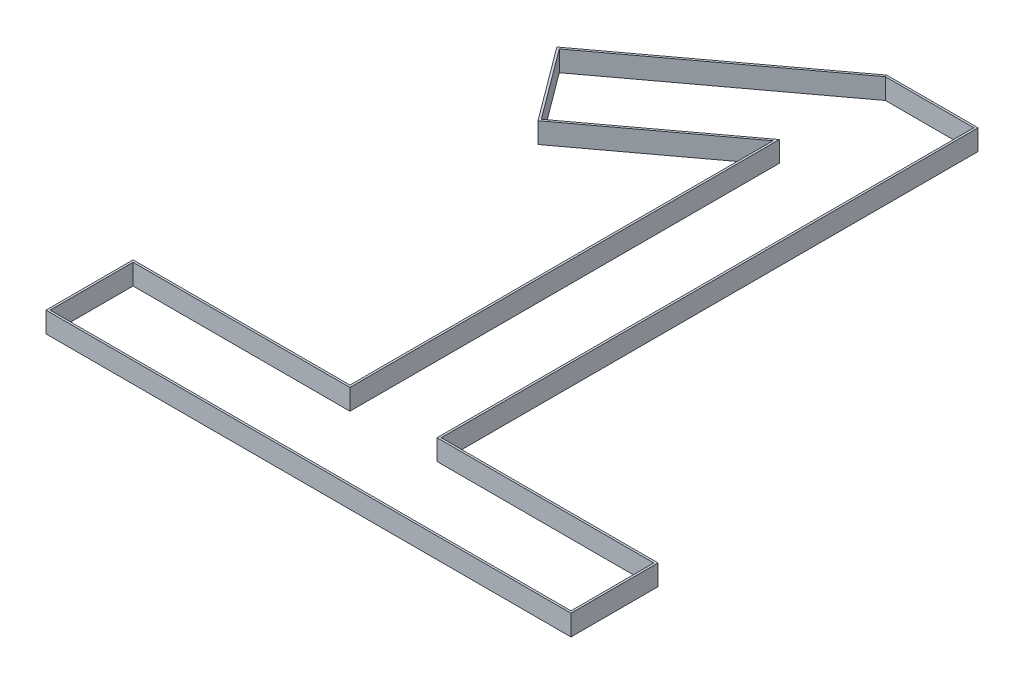
ISO-10303-21;
HEADER;
FILE_DESCRIPTION(('STEP AP214'),'2;1');
FILE_NAME('part.step','',(''),(''),'','','');
FILE_SCHEMA(('AUTOMOTIVE_DESIGN { 1 0 10303 214 1 1 1 1 }'));
ENDSEC;
DATA;
#1=APPLICATION_CONTEXT('core data for automotive mechanical design processes');
#2=APPLICATION_PROTOCOL_DEFINITION('international standard','automotive_design',2000,#1);
#3=PRODUCT_CONTEXT('',#1,'mechanical');
#4=PRODUCT('Part','Part','',(#3));
#5=PRODUCT_RELATED_PRODUCT_CATEGORY('part','',(#4));
#6=PRODUCT_DEFINITION_FORMATION('','',#4);
#7=PRODUCT_DEFINITION_CONTEXT('part definition',#1,'design');
#8=PRODUCT_DEFINITION('design','',#6,#7);
#9=PRODUCT_DEFINITION_SHAPE('','',#8);
#10=(LENGTH_UNIT() NAMED_UNIT(*) SI_UNIT(.MILLI.,.METRE.));
#11=(NAMED_UNIT(*) PLANE_ANGLE_UNIT() SI_UNIT($,.RADIAN.));
#12=(NAMED_UNIT(*) SI_UNIT($,.STERADIAN.) SOLID_ANGLE_UNIT());
#13=UNCERTAINTY_MEASURE_WITH_UNIT(LENGTH_MEASURE(1.E-05),#10,'distance_accuracy_value','');
#14=(GEOMETRIC_REPRESENTATION_CONTEXT(3) GLOBAL_UNCERTAINTY_ASSIGNED_CONTEXT((#13)) GLOBAL_UNIT_ASSIGNED_CONTEXT((#10,
#11,#12)) REPRESENTATION_CONTEXT('',''));
#15=CARTESIAN_POINT('',(0.,0.,0.));
#16=DIRECTION('',(0.,0.,1.));
#17=DIRECTION('',(1.,0.,0.));
#18=AXIS2_PLACEMENT_3D('',#15,#16,#17);
#19=CARTESIAN_POINT('',(0.,1.,0.));
#20=DIRECTION('',(0.,1.,0.));
#21=DIRECTION('',(0.,0.,1.));
#22=AXIS2_PLACEMENT_3D('',#19,#20,#21);
#23=PLANE('',#22);
#24=DIRECTION('',(0.,0.,1.));
#25=VECTOR('',#24,1.);
#26=CARTESIAN_POINT('',(-12.7264369980595,1.,-4.22163429439328));
#27=LINE('',#26,#25);
#28=CARTESIAN_POINT('',(-12.7264369980595,1.,-4.22163429439328));
#29=VERTEX_POINT('',#28);
#30=CARTESIAN_POINT('',(-12.7264369980595,1.,0.));
#31=VERTEX_POINT('',#30);
#32=EDGE_CURVE('E270',#29,#31,#27,.T.);
#33=ORIENTED_EDGE('',*,*,#32,.T.);
#34=DIRECTION('',(1.,0.,0.));
#35=VECTOR('',#34,1.);
#36=CARTESIAN_POINT('',(-12.7264369980595,1.,0.));
#37=LINE('',#36,#35);
#38=CARTESIAN_POINT('',(12.7264369980595,1.,0.));
#39=VERTEX_POINT('',#38);
#40=EDGE_CURVE('E273',#31,#39,#37,.T.);
#41=ORIENTED_EDGE('',*,*,#40,.T.);
#42=DIRECTION('',(0.,0.,-1.));
#43=VECTOR('',#42,1.);
#44=CARTESIAN_POINT('',(12.7264369980595,1.,0.));
#45=LINE('',#44,#43);
#46=CARTESIAN_POINT('',(12.7264369980595,1.,-4.22163429439328));
#47=VERTEX_POINT('',#46);
#48=EDGE_CURVE('E276',#39,#47,#45,.T.);
#49=ORIENTED_EDGE('',*,*,#48,.T.);
#50=DIRECTION('',(-1.,0.,0.));
#51=VECTOR('',#50,1.);
#52=CARTESIAN_POINT('',(12.7264369980595,1.,-4.22163429439328));
#53=LINE('',#52,#51);
#54=CARTESIAN_POINT('',(2.2119484060336,1.,-4.22163429439328));
#55=VERTEX_POINT('',#54);
#56=EDGE_CURVE('E278',#47,#55,#53,.T.);
#57=ORIENTED_EDGE('',*,*,#56,.T.);
#58=DIRECTION('',(0.,0.,-1.));
#59=VECTOR('',#58,1.);
#60=CARTESIAN_POINT('',(2.2119484060336,1.,-4.22163429439328));
#61=LINE('',#60,#59);
#62=CARTESIAN_POINT('',(2.2119484060336,1.,-30.2508901146529));
#63=VERTEX_POINT('',#62);
#64=EDGE_CURVE('E280',#55,#63,#61,.T.);
#65=ORIENTED_EDGE('',*,*,#64,.T.);
#66=DIRECTION('',(-1.,0.,0.));
#67=VECTOR('',#66,1.);
#68=CARTESIAN_POINT('',(2.2119484060336,1.,-30.2508901146529));
#69=LINE('',#68,#67);
#70=CARTESIAN_POINT('',(-2.2119484060336,1.,-30.2508901146529));
#71=VERTEX_POINT('',#70);
#72=EDGE_CURVE('E282',#63,#71,#69,.T.);
#73=ORIENTED_EDGE('',*,*,#72,.T.);
#74=DIRECTION('',(-0.802743847954451,0.,0.596324001337596));
#75=VECTOR('',#74,1.);
#76=CARTESIAN_POINT('',(-2.2119484060336,1.,-30.2508901146529));
#77=LINE('',#76,#75);
#78=CARTESIAN_POINT('',(-11.3906703261635,1.,-23.4324109739849));
#79=VERTEX_POINT('',#78);
#80=EDGE_CURVE('E284',#71,#79,#77,.T.);
#81=ORIENTED_EDGE('',*,*,#80,.T.);
#82=DIRECTION('',(0.596324001337596,0.,0.802743847954451));
#83=VECTOR('',#82,1.);
#84=CARTESIAN_POINT('',(-11.3906703261635,1.,-23.4324109739849));
#85=LINE('',#84,#83);
#86=CARTESIAN_POINT('',(-8.75259447768699,1.,-19.8811550241127));
#87=VERTEX_POINT('',#86);
#88=EDGE_CURVE('E286',#79,#87,#85,.T.);
#89=ORIENTED_EDGE('',*,*,#88,.T.);
#90=DIRECTION('',(0.802743847954451,0.,-0.596324001337596));
#91=VECTOR('',#90,1.);
#92=CARTESIAN_POINT('',(-8.75259447768699,1.,-19.8811550241127));
#93=LINE('',#92,#91);
#94=CARTESIAN_POINT('',(-2.2119484060336,1.,-24.7399206773409));
#95=VERTEX_POINT('',#94);
#96=EDGE_CURVE('E288',#87,#95,#93,.T.);
#97=ORIENTED_EDGE('',*,*,#96,.T.);
#98=DIRECTION('',(0.,0.,1.));
#99=VECTOR('',#98,1.);
#100=CARTESIAN_POINT('',(-2.2119484060336,1.,-24.7399206773409));
#101=LINE('',#100,#99);
#102=CARTESIAN_POINT('',(-2.2119484060336,1.,-4.22163429439328));
#103=VERTEX_POINT('',#102);
#104=EDGE_CURVE('E290',#95,#103,#101,.T.);
#105=ORIENTED_EDGE('',*,*,#104,.T.);
#106=DIRECTION('',(-1.,0.,0.));
#107=VECTOR('',#106,1.);
#108=CARTESIAN_POINT('',(-2.2119484060336,1.,-4.22163429439328));
#109=LINE('',#108,#107);
#110=EDGE_CURVE('E292',#103,#29,#109,.T.);
#111=ORIENTED_EDGE('',*,*,#110,.T.);
#112=EDGE_LOOP('',(#33,#41,#49,#57,#65,#73,#81,#89,#97,#105,#111));
#113=FACE_BOUND('',#112,.T.);
#114=DIRECTION('',(-0.802743847954451,0.,0.596324001337596));
#115=VECTOR('',#114,1.);
#116=CARTESIAN_POINT('',(-2.17886971867521,1.,-30.1508901146529));
#117=LINE('',#116,#115);
#118=CARTESIAN_POINT('',(-2.17886971867521,1.,-30.1508901146529));
#119=VERTEX_POINT('',#118);
#120=CARTESIAN_POINT('',(-11.2507635412343,1.,-23.4117689893233));
#121=VERTEX_POINT('',#120);
#122=EDGE_CURVE('E192',#119,#121,#117,.T.);
#123=ORIENTED_EDGE('',*,*,#122,.F.);
#124=DIRECTION('',(-1.,0.,0.));
#125=VECTOR('',#124,1.);
#126=CARTESIAN_POINT('',(2.1119484060336,1.,-30.1508901146529));
#127=LINE('',#126,#125);
#128=CARTESIAN_POINT('',(2.1119484060336,1.,-30.1508901146529));
#129=VERTEX_POINT('',#128);
#130=EDGE_CURVE('E184',#129,#119,#127,.T.);
#131=ORIENTED_EDGE('',*,*,#130,.F.);
#132=DIRECTION('',(0.,0.,-1.));
#133=VECTOR('',#132,1.);
#134=CARTESIAN_POINT('',(2.1119484060336,1.,-4.12163429439328));
#135=LINE('',#134,#133);
#136=CARTESIAN_POINT('',(2.1119484060336,1.,-4.12163429439328));
#137=VERTEX_POINT('',#136);
#138=EDGE_CURVE('E223',#137,#129,#135,.T.);
#139=ORIENTED_EDGE('',*,*,#138,.F.);
#140=DIRECTION('',(-1.,0.,0.));
#141=VECTOR('',#140,1.);
#142=CARTESIAN_POINT('',(12.6264369980595,1.,-4.12163429439328));
#143=LINE('',#142,#141);
#144=CARTESIAN_POINT('',(12.6264369980595,1.,-4.12163429439328));
#145=VERTEX_POINT('',#144);
#146=EDGE_CURVE('E221',#145,#137,#143,.T.);
#147=ORIENTED_EDGE('',*,*,#146,.F.);
#148=DIRECTION('',(0.,0.,-1.));
#149=VECTOR('',#148,1.);
#150=CARTESIAN_POINT('',(12.6264369980595,1.,-0.1));
#151=LINE('',#150,#149);
#152=CARTESIAN_POINT('',(12.6264369980595,1.,-0.1));
#153=VERTEX_POINT('',#152);
#154=EDGE_CURVE('E219',#153,#145,#151,.T.);
#155=ORIENTED_EDGE('',*,*,#154,.F.);
#156=DIRECTION('',(1.,0.,0.));
#157=VECTOR('',#156,1.);
#158=CARTESIAN_POINT('',(-12.6264369980595,1.,-0.1));
#159=LINE('',#158,#157);
#160=CARTESIAN_POINT('',(-12.6264369980595,1.,-0.1));
#161=VERTEX_POINT('',#160);
#162=EDGE_CURVE('E217',#161,#153,#159,.T.);
#163=ORIENTED_EDGE('',*,*,#162,.F.);
#164=DIRECTION('',(0.,0.,1.));
#165=VECTOR('',#164,1.);
#166=CARTESIAN_POINT('',(-12.6264369980595,1.,-4.12163429439328));
#167=LINE('',#166,#165);
#168=CARTESIAN_POINT('',(-12.6264369980595,1.,-4.12163429439328));
#169=VERTEX_POINT('',#168);
#170=EDGE_CURVE('E215',#169,#161,#167,.T.);
#171=ORIENTED_EDGE('',*,*,#170,.F.);
#172=DIRECTION('',(-1.,0.,0.));
#173=VECTOR('',#172,1.);
#174=CARTESIAN_POINT('',(-2.1119484060336,1.,-4.12163429439328));
#175=LINE('',#174,#173);
#176=CARTESIAN_POINT('',(-2.1119484060336,1.,-4.12163429439328));
#177=VERTEX_POINT('',#176);
#178=EDGE_CURVE('E213',#177,#169,#175,.T.);
#179=ORIENTED_EDGE('',*,*,#178,.F.);
#180=DIRECTION('',(0.,0.,1.));
#181=VECTOR('',#180,1.);
#182=CARTESIAN_POINT('',(-2.1119484060336,1.,-24.9387791308072));
#183=LINE('',#182,#181);
#184=CARTESIAN_POINT('',(-2.1119484060336,1.,-24.9387791308072));
#185=VERTEX_POINT('',#184);
#186=EDGE_CURVE('E211',#185,#177,#183,.T.);
#187=ORIENTED_EDGE('',*,*,#186,.F.);
#188=DIRECTION('',(0.802743847954451,0.,-0.596324001337596));
#189=VECTOR('',#188,1.);
#190=CARTESIAN_POINT('',(-8.73195249302531,1.,-20.0210618090419));
#191=LINE('',#190,#189);
#192=CARTESIAN_POINT('',(-8.73195249302531,1.,-20.0210618090419));
#193=VERTEX_POINT('',#192);
#194=EDGE_CURVE('E207',#193,#185,#191,.T.);
#195=ORIENTED_EDGE('',*,*,#194,.F.);
#196=DIRECTION('',(0.596324001337596,0.,0.802743847954451));
#197=VECTOR('',#196,1.);
#198=CARTESIAN_POINT('',(-11.2507635412343,1.,-23.4117689893233));
#199=LINE('',#198,#197);
#200=EDGE_CURVE('E205',#121,#193,#199,.T.);
#201=ORIENTED_EDGE('',*,*,#200,.F.);
#202=EDGE_LOOP('',(#123,#131,#139,#147,#155,#163,#171,#179,#187,#195,#201));
#203=FACE_BOUND('',#202,.T.);
#204=ADVANCED_FACE('F35',(#113,#203),#23,.T.);
#205=CARTESIAN_POINT('',(0.,0.,0.));
#206=DIRECTION('',(0.,1.,0.));
#207=DIRECTION('',(0.,0.,1.));
#208=AXIS2_PLACEMENT_3D('',#205,#206,#207);
#209=PLANE('',#208);
#210=DIRECTION('',(0.,0.,1.));
#211=VECTOR('',#210,1.);
#212=CARTESIAN_POINT('',(-12.7264369980595,0.,-4.22163429439328));
#213=LINE('',#212,#211);
#214=CARTESIAN_POINT('',(-12.7264369980595,0.,-4.22163429439328));
#215=VERTEX_POINT('',#214);
#216=CARTESIAN_POINT('',(-12.7264369980595,0.,0.));
#217=VERTEX_POINT('',#216);
#218=EDGE_CURVE('E200',#215,#217,#213,.T.);
#219=ORIENTED_EDGE('',*,*,#218,.F.);
#220=DIRECTION('',(-1.,0.,0.));
#221=VECTOR('',#220,1.);
#222=CARTESIAN_POINT('',(-2.2119484060336,0.,-4.22163429439328));
#223=LINE('',#222,#221);
#224=CARTESIAN_POINT('',(-2.2119484060336,0.,-4.22163429439328));
#225=VERTEX_POINT('',#224);
#226=EDGE_CURVE('E274',#225,#215,#223,.T.);
#227=ORIENTED_EDGE('',*,*,#226,.F.);
#228=DIRECTION('',(0.,0.,1.));
#229=VECTOR('',#228,1.);
#230=CARTESIAN_POINT('',(-2.2119484060336,0.,-24.7399206773409));
#231=LINE('',#230,#229);
#232=CARTESIAN_POINT('',(-2.2119484060336,0.,-24.7399206773409));
#233=VERTEX_POINT('',#232);
#234=EDGE_CURVE('E313',#233,#225,#231,.T.);
#235=ORIENTED_EDGE('',*,*,#234,.F.);
#236=DIRECTION('',(0.802743847954451,0.,-0.596324001337596));
#237=VECTOR('',#236,1.);
#238=CARTESIAN_POINT('',(-8.75259447768699,0.,-19.8811550241127));
#239=LINE('',#238,#237);
#240=CARTESIAN_POINT('',(-8.75259447768699,0.,-19.8811550241127));
#241=VERTEX_POINT('',#240);
#242=EDGE_CURVE('E311',#241,#233,#239,.T.);
#243=ORIENTED_EDGE('',*,*,#242,.F.);
#244=DIRECTION('',(0.596324001337596,0.,0.802743847954451));
#245=VECTOR('',#244,1.);
#246=CARTESIAN_POINT('',(-11.3906703261635,0.,-23.4324109739849));
#247=LINE('',#246,#245);
#248=CARTESIAN_POINT('',(-11.3906703261635,0.,-23.4324109739849));
#249=VERTEX_POINT('',#248);
#250=EDGE_CURVE('E309',#249,#241,#247,.T.);
#251=ORIENTED_EDGE('',*,*,#250,.F.);
#252=DIRECTION('',(-0.802743847954451,0.,0.596324001337596));
#253=VECTOR('',#252,1.);
#254=CARTESIAN_POINT('',(-2.2119484060336,0.,-30.2508901146529));
#255=LINE('',#254,#253);
#256=CARTESIAN_POINT('',(-2.2119484060336,0.,-30.2508901146529));
#257=VERTEX_POINT('',#256);
#258=EDGE_CURVE('E307',#257,#249,#255,.T.);
#259=ORIENTED_EDGE('',*,*,#258,.F.);
#260=DIRECTION('',(-1.,0.,0.));
#261=VECTOR('',#260,1.);
#262=CARTESIAN_POINT('',(2.2119484060336,0.,-30.2508901146529));
#263=LINE('',#262,#261);
#264=CARTESIAN_POINT('',(2.2119484060336,0.,-30.2508901146529));
#265=VERTEX_POINT('',#264);
#266=EDGE_CURVE('E305',#265,#257,#263,.T.);
#267=ORIENTED_EDGE('',*,*,#266,.F.);
#268=DIRECTION('',(0.,0.,-1.));
#269=VECTOR('',#268,1.);
#270=CARTESIAN_POINT('',(2.2119484060336,0.,-4.22163429439328));
#271=LINE('',#270,#269);
#272=CARTESIAN_POINT('',(2.2119484060336,0.,-4.22163429439328));
#273=VERTEX_POINT('',#272);
#274=EDGE_CURVE('E303',#273,#265,#271,.T.);
#275=ORIENTED_EDGE('',*,*,#274,.F.);
#276=DIRECTION('',(-1.,0.,0.));
#277=VECTOR('',#276,1.);
#278=CARTESIAN_POINT('',(12.7264369980595,0.,-4.22163429439328));
#279=LINE('',#278,#277);
#280=CARTESIAN_POINT('',(12.7264369980595,0.,-4.22163429439328));
#281=VERTEX_POINT('',#280);
#282=EDGE_CURVE('E301',#281,#273,#279,.T.);
#283=ORIENTED_EDGE('',*,*,#282,.F.);
#284=DIRECTION('',(0.,0.,-1.));
#285=VECTOR('',#284,1.);
#286=CARTESIAN_POINT('',(12.7264369980595,0.,0.));
#287=LINE('',#286,#285);
#288=CARTESIAN_POINT('',(12.7264369980595,0.,0.));
#289=VERTEX_POINT('',#288);
#290=EDGE_CURVE('E299',#289,#281,#287,.T.);
#291=ORIENTED_EDGE('',*,*,#290,.F.);
#292=DIRECTION('',(1.,0.,0.));
#293=VECTOR('',#292,1.);
#294=CARTESIAN_POINT('',(-12.7264369980595,0.,0.));
#295=LINE('',#294,#293);
#296=EDGE_CURVE('E297',#217,#289,#295,.T.);
#297=ORIENTED_EDGE('',*,*,#296,.F.);
#298=EDGE_LOOP('',(#219,#227,#235,#243,#251,#259,#267,#275,#283,#291,#297));
#299=FACE_BOUND('',#298,.T.);
#300=DIRECTION('',(-1.,0.,0.));
#301=VECTOR('',#300,1.);
#302=CARTESIAN_POINT('',(2.1119484060336,0.,-30.1508901146529));
#303=LINE('',#302,#301);
#304=CARTESIAN_POINT('',(2.1119484060336,0.,-30.1508901146529));
#305=VERTEX_POINT('',#304);
#306=CARTESIAN_POINT('',(-2.17886971867521,0.,-30.1508901146529));
#307=VERTEX_POINT('',#306);
#308=EDGE_CURVE('E58',#305,#307,#303,.T.);
#309=ORIENTED_EDGE('',*,*,#308,.T.);
#310=DIRECTION('',(-0.802743847954451,0.,0.596324001337596));
#311=VECTOR('',#310,1.);
#312=CARTESIAN_POINT('',(-2.17886971867521,0.,-30.1508901146529));
#313=LINE('',#312,#311);
#314=CARTESIAN_POINT('',(-11.2507635412343,0.,-23.4117689893233));
#315=VERTEX_POINT('',#314);
#316=EDGE_CURVE('E199',#307,#315,#313,.T.);
#317=ORIENTED_EDGE('',*,*,#316,.T.);
#318=DIRECTION('',(0.596324001337596,0.,0.802743847954451));
#319=VECTOR('',#318,1.);
#320=CARTESIAN_POINT('',(-11.2507635412343,0.,-23.4117689893233));
#321=LINE('',#320,#319);
#322=CARTESIAN_POINT('',(-8.73195249302531,0.,-20.0210618090419));
#323=VERTEX_POINT('',#322);
#324=EDGE_CURVE('E227',#315,#323,#321,.T.);
#325=ORIENTED_EDGE('',*,*,#324,.T.);
#326=DIRECTION('',(0.802743847954451,0.,-0.596324001337596));
#327=VECTOR('',#326,1.);
#328=CARTESIAN_POINT('',(-8.73195249302531,0.,-20.0210618090419));
#329=LINE('',#328,#327);
#330=CARTESIAN_POINT('',(-2.1119484060336,0.,-24.9387791308072));
#331=VERTEX_POINT('',#330);
#332=EDGE_CURVE('E230',#323,#331,#329,.T.);
#333=ORIENTED_EDGE('',*,*,#332,.T.);
#334=DIRECTION('',(0.,0.,1.));
#335=VECTOR('',#334,1.);
#336=CARTESIAN_POINT('',(-2.1119484060336,0.,-24.9387791308072));
#337=LINE('',#336,#335);
#338=CARTESIAN_POINT('',(-2.1119484060336,0.,-4.12163429439328));
#339=VERTEX_POINT('',#338);
#340=EDGE_CURVE('E233',#331,#339,#337,.T.);
#341=ORIENTED_EDGE('',*,*,#340,.T.);
#342=DIRECTION('',(-1.,0.,0.));
#343=VECTOR('',#342,1.);
#344=CARTESIAN_POINT('',(-2.1119484060336,0.,-4.12163429439328));
#345=LINE('',#344,#343);
#346=CARTESIAN_POINT('',(-12.6264369980595,0.,-4.12163429439328));
#347=VERTEX_POINT('',#346);
#348=EDGE_CURVE('E236',#339,#347,#345,.T.);
#349=ORIENTED_EDGE('',*,*,#348,.T.);
#350=DIRECTION('',(0.,0.,1.));
#351=VECTOR('',#350,1.);
#352=CARTESIAN_POINT('',(-12.6264369980595,0.,-4.12163429439328));
#353=LINE('',#352,#351);
#354=CARTESIAN_POINT('',(-12.6264369980595,0.,-0.1));
#355=VERTEX_POINT('',#354);
#356=EDGE_CURVE('E239',#347,#355,#353,.T.);
#357=ORIENTED_EDGE('',*,*,#356,.T.);
#358=DIRECTION('',(1.,0.,0.));
#359=VECTOR('',#358,1.);
#360=CARTESIAN_POINT('',(-12.6264369980595,0.,-0.1));
#361=LINE('',#360,#359);
#362=CARTESIAN_POINT('',(12.6264369980595,0.,-0.1));
#363=VERTEX_POINT('',#362);
#364=EDGE_CURVE('E242',#355,#363,#361,.T.);
#365=ORIENTED_EDGE('',*,*,#364,.T.);
#366=DIRECTION('',(0.,0.,-1.));
#367=VECTOR('',#366,1.);
#368=CARTESIAN_POINT('',(12.6264369980595,0.,-0.1));
#369=LINE('',#368,#367);
#370=CARTESIAN_POINT('',(12.6264369980595,0.,-4.12163429439328));
#371=VERTEX_POINT('',#370);
#372=EDGE_CURVE('E245',#363,#371,#369,.T.);
#373=ORIENTED_EDGE('',*,*,#372,.T.);
#374=DIRECTION('',(-1.,0.,0.));
#375=VECTOR('',#374,1.);
#376=CARTESIAN_POINT('',(12.6264369980595,0.,-4.12163429439328));
#377=LINE('',#376,#375);
#378=CARTESIAN_POINT('',(2.1119484060336,0.,-4.12163429439328));
#379=VERTEX_POINT('',#378);
#380=EDGE_CURVE('E248',#371,#379,#377,.T.);
#381=ORIENTED_EDGE('',*,*,#380,.T.);
#382=DIRECTION('',(0.,0.,-1.));
#383=VECTOR('',#382,1.);
#384=CARTESIAN_POINT('',(2.1119484060336,0.,-4.12163429439328));
#385=LINE('',#384,#383);
#386=EDGE_CURVE('E193',#379,#305,#385,.T.);
#387=ORIENTED_EDGE('',*,*,#386,.T.);
#388=EDGE_LOOP('',(#309,#317,#325,#333,#341,#349,#357,#365,#373,#381,#387));
#389=FACE_BOUND('',#388,.T.);
#390=ADVANCED_FACE('F352',(#299,#389),#209,.F.);
#391=CARTESIAN_POINT('',(-12.7264369980595,1.,-4.22163429439328));
#392=DIRECTION('',(1.,0.,0.));
#393=DIRECTION('',(0.,0.,-1.));
#394=AXIS2_PLACEMENT_3D('',#391,#392,#393);
#395=PLANE('',#394);
#396=ORIENTED_EDGE('',*,*,#218,.T.);
#397=DIRECTION('',(0.,-1.,0.));
#398=VECTOR('',#397,1.);
#399=CARTESIAN_POINT('',(-12.7264369980595,1.,0.));
#400=LINE('',#399,#398);
#401=EDGE_CURVE('E11',#31,#217,#400,.T.);
#402=ORIENTED_EDGE('',*,*,#401,.F.);
#403=ORIENTED_EDGE('',*,*,#32,.F.);
#404=DIRECTION('',(0.,-1.,0.));
#405=VECTOR('',#404,1.);
#406=CARTESIAN_POINT('',(-12.7264369980595,1.,-4.22163429439328));
#407=LINE('',#406,#405);
#408=EDGE_CURVE('E294',#29,#215,#407,.T.);
#409=ORIENTED_EDGE('',*,*,#408,.T.);
#410=EDGE_LOOP('',(#396,#402,#403,#409));
#411=FACE_BOUND('',#410,.T.);
#412=ADVANCED_FACE('F37',(#411),#395,.F.);
#413=CARTESIAN_POINT('',(-12.7264369980595,1.,0.));
#414=DIRECTION('',(0.,0.,-1.));
#415=DIRECTION('',(-1.,0.,0.));
#416=AXIS2_PLACEMENT_3D('',#413,#414,#415);
#417=PLANE('',#416);
#418=ORIENTED_EDGE('',*,*,#296,.T.);
#419=DIRECTION('',(0.,-1.,0.));
#420=VECTOR('',#419,1.);
#421=CARTESIAN_POINT('',(12.7264369980595,1.,0.));
#422=LINE('',#421,#420);
#423=EDGE_CURVE('E43',#39,#289,#422,.T.);
#424=ORIENTED_EDGE('',*,*,#423,.F.);
#425=ORIENTED_EDGE('',*,*,#40,.F.);
#426=ORIENTED_EDGE('',*,*,#401,.T.);
#427=EDGE_LOOP('',(#418,#424,#425,#426));
#428=FACE_BOUND('',#427,.T.);
#429=ADVANCED_FACE('F369',(#428),#417,.F.);
#430=CARTESIAN_POINT('',(12.7264369980595,1.,0.));
#431=DIRECTION('',(-1.,0.,0.));
#432=DIRECTION('',(0.,0.,1.));
#433=AXIS2_PLACEMENT_3D('',#430,#431,#432);
#434=PLANE('',#433);
#435=ORIENTED_EDGE('',*,*,#290,.T.);
#436=DIRECTION('',(0.,-1.,0.));
#437=VECTOR('',#436,1.);
#438=CARTESIAN_POINT('',(12.7264369980595,1.,-4.22163429439328));
#439=LINE('',#438,#437);
#440=EDGE_CURVE('E339',#47,#281,#439,.T.);
#441=ORIENTED_EDGE('',*,*,#440,.F.);
#442=ORIENTED_EDGE('',*,*,#48,.F.);
#443=ORIENTED_EDGE('',*,*,#423,.T.);
#444=EDGE_LOOP('',(#435,#441,#442,#443));
#445=FACE_BOUND('',#444,.T.);
#446=ADVANCED_FACE('F346',(#445),#434,.F.);
#447=CARTESIAN_POINT('',(12.7264369980595,1.,-4.22163429439328));
#448=DIRECTION('',(0.,0.,1.));
#449=DIRECTION('',(1.,0.,0.));
#450=AXIS2_PLACEMENT_3D('',#447,#448,#449);
#451=PLANE('',#450);
#452=ORIENTED_EDGE('',*,*,#282,.T.);
#453=DIRECTION('',(0.,-1.,0.));
#454=VECTOR('',#453,1.);
#455=CARTESIAN_POINT('',(2.2119484060336,1.,-4.22163429439328));
#456=LINE('',#455,#454);
#457=EDGE_CURVE('E336',#55,#273,#456,.T.);
#458=ORIENTED_EDGE('',*,*,#457,.F.);
#459=ORIENTED_EDGE('',*,*,#56,.F.);
#460=ORIENTED_EDGE('',*,*,#440,.T.);
#461=EDGE_LOOP('',(#452,#458,#459,#460));
#462=FACE_BOUND('',#461,.T.);
#463=ADVANCED_FACE('F358',(#462),#451,.F.);
#464=CARTESIAN_POINT('',(2.2119484060336,1.,-4.22163429439328));
#465=DIRECTION('',(-1.,0.,0.));
#466=DIRECTION('',(0.,0.,1.));
#467=AXIS2_PLACEMENT_3D('',#464,#465,#466);
#468=PLANE('',#467);
#469=ORIENTED_EDGE('',*,*,#274,.T.);
#470=DIRECTION('',(0.,-1.,0.));
#471=VECTOR('',#470,1.);
#472=CARTESIAN_POINT('',(2.2119484060336,1.,-30.2508901146529));
#473=LINE('',#472,#471);
#474=EDGE_CURVE('E333',#63,#265,#473,.T.);
#475=ORIENTED_EDGE('',*,*,#474,.F.);
#476=ORIENTED_EDGE('',*,*,#64,.F.);
#477=ORIENTED_EDGE('',*,*,#457,.T.);
#478=EDGE_LOOP('',(#469,#475,#476,#477));
#479=FACE_BOUND('',#478,.T.);
#480=ADVANCED_FACE('F362',(#479),#468,.F.);
#481=CARTESIAN_POINT('',(2.2119484060336,1.,-30.2508901146529));
#482=DIRECTION('',(0.,0.,1.));
#483=DIRECTION('',(1.,0.,0.));
#484=AXIS2_PLACEMENT_3D('',#481,#482,#483);
#485=PLANE('',#484);
#486=ORIENTED_EDGE('',*,*,#266,.T.);
#487=DIRECTION('',(0.,-1.,0.));
#488=VECTOR('',#487,1.);
#489=CARTESIAN_POINT('',(-2.2119484060336,1.,-30.2508901146529));
#490=LINE('',#489,#488);
#491=EDGE_CURVE('E330',#71,#257,#490,.T.);
#492=ORIENTED_EDGE('',*,*,#491,.F.);
#493=ORIENTED_EDGE('',*,*,#72,.F.);
#494=ORIENTED_EDGE('',*,*,#474,.T.);
#495=EDGE_LOOP('',(#486,#492,#493,#494));
#496=FACE_BOUND('',#495,.T.);
#497=ADVANCED_FACE('F397',(#496),#485,.F.);
#498=CARTESIAN_POINT('',(-2.2119484060336,1.,-30.2508901146529));
#499=DIRECTION('',(0.596324001337596,0.,0.802743847954451));
#500=DIRECTION('',(0.802743847954451,0.,-0.596324001337596));
#501=AXIS2_PLACEMENT_3D('',#498,#499,#500);
#502=PLANE('',#501);
#503=ORIENTED_EDGE('',*,*,#258,.T.);
#504=DIRECTION('',(0.,-1.,0.));
#505=VECTOR('',#504,1.);
#506=CARTESIAN_POINT('',(-11.3906703261635,1.,-23.4324109739849));
#507=LINE('',#506,#505);
#508=EDGE_CURVE('E327',#79,#249,#507,.T.);
#509=ORIENTED_EDGE('',*,*,#508,.F.);
#510=ORIENTED_EDGE('',*,*,#80,.F.);
#511=ORIENTED_EDGE('',*,*,#491,.T.);
#512=EDGE_LOOP('',(#503,#509,#510,#511));
#513=FACE_BOUND('',#512,.T.);
#514=ADVANCED_FACE('F395',(#513),#502,.F.);
#515=CARTESIAN_POINT('',(-11.3906703261635,1.,-23.4324109739849));
#516=DIRECTION('',(0.802743847954451,0.,-0.596324001337596));
#517=DIRECTION('',(-0.596324001337596,0.,-0.802743847954451));
#518=AXIS2_PLACEMENT_3D('',#515,#516,#517);
#519=PLANE('',#518);
#520=ORIENTED_EDGE('',*,*,#250,.T.);
#521=DIRECTION('',(0.,-1.,0.));
#522=VECTOR('',#521,1.);
#523=CARTESIAN_POINT('',(-8.75259447768699,1.,-19.8811550241127));
#524=LINE('',#523,#522);
#525=EDGE_CURVE('E324',#87,#241,#524,.T.);
#526=ORIENTED_EDGE('',*,*,#525,.F.);
#527=ORIENTED_EDGE('',*,*,#88,.F.);
#528=ORIENTED_EDGE('',*,*,#508,.T.);
#529=EDGE_LOOP('',(#520,#526,#527,#528));
#530=FACE_BOUND('',#529,.T.);
#531=ADVANCED_FACE('F390',(#530),#519,.F.);
#532=CARTESIAN_POINT('',(-8.75259447768699,1.,-19.8811550241127));
#533=DIRECTION('',(-0.596324001337596,0.,-0.802743847954451));
#534=DIRECTION('',(-0.802743847954451,0.,0.596324001337596));
#535=AXIS2_PLACEMENT_3D('',#532,#533,#534);
#536=PLANE('',#535);
#537=ORIENTED_EDGE('',*,*,#242,.T.);
#538=DIRECTION('',(0.,-1.,0.));
#539=VECTOR('',#538,1.);
#540=CARTESIAN_POINT('',(-2.2119484060336,1.,-24.7399206773409));
#541=LINE('',#540,#539);
#542=EDGE_CURVE('E321',#95,#233,#541,.T.);
#543=ORIENTED_EDGE('',*,*,#542,.F.);
#544=ORIENTED_EDGE('',*,*,#96,.F.);
#545=ORIENTED_EDGE('',*,*,#525,.T.);
#546=EDGE_LOOP('',(#537,#543,#544,#545));
#547=FACE_BOUND('',#546,.T.);
#548=ADVANCED_FACE('F385',(#547),#536,.F.);
#549=CARTESIAN_POINT('',(-2.2119484060336,1.,-24.7399206773409));
#550=DIRECTION('',(1.,0.,0.));
#551=DIRECTION('',(0.,0.,-1.));
#552=AXIS2_PLACEMENT_3D('',#549,#550,#551);
#553=PLANE('',#552);
#554=ORIENTED_EDGE('',*,*,#234,.T.);
#555=DIRECTION('',(0.,-1.,0.));
#556=VECTOR('',#555,1.);
#557=CARTESIAN_POINT('',(-2.2119484060336,1.,-4.22163429439328));
#558=LINE('',#557,#556);
#559=EDGE_CURVE('E318',#103,#225,#558,.T.);
#560=ORIENTED_EDGE('',*,*,#559,.F.);
#561=ORIENTED_EDGE('',*,*,#104,.F.);
#562=ORIENTED_EDGE('',*,*,#542,.T.);
#563=EDGE_LOOP('',(#554,#560,#561,#562));
#564=FACE_BOUND('',#563,.T.);
#565=ADVANCED_FACE('F381',(#564),#553,.F.);
#566=CARTESIAN_POINT('',(-2.2119484060336,1.,-4.22163429439328));
#567=DIRECTION('',(0.,0.,1.));
#568=DIRECTION('',(1.,0.,0.));
#569=AXIS2_PLACEMENT_3D('',#566,#567,#568);
#570=PLANE('',#569);
#571=ORIENTED_EDGE('',*,*,#226,.T.);
#572=ORIENTED_EDGE('',*,*,#408,.F.);
#573=ORIENTED_EDGE('',*,*,#110,.F.);
#574=ORIENTED_EDGE('',*,*,#559,.T.);
#575=EDGE_LOOP('',(#571,#572,#573,#574));
#576=FACE_BOUND('',#575,.T.);
#577=ADVANCED_FACE('F376',(#576),#570,.F.);
#578=CARTESIAN_POINT('',(2.1119484060336,1.,-30.1508901146529));
#579=DIRECTION('',(0.,0.,1.));
#580=DIRECTION('',(1.,0.,0.));
#581=AXIS2_PLACEMENT_3D('',#578,#579,#580);
#582=PLANE('',#581);
#583=ORIENTED_EDGE('',*,*,#308,.F.);
#584=DIRECTION('',(0.,-1.,0.));
#585=VECTOR('',#584,1.);
#586=CARTESIAN_POINT('',(2.1119484060336,1.,-30.1508901146529));
#587=LINE('',#586,#585);
#588=EDGE_CURVE('E188',#129,#305,#587,.T.);
#589=ORIENTED_EDGE('',*,*,#588,.F.);
#590=ORIENTED_EDGE('',*,*,#130,.T.);
#591=DIRECTION('',(0.,-1.,0.));
#592=VECTOR('',#591,1.);
#593=CARTESIAN_POINT('',(-2.17886971867521,1.,-30.1508901146529));
#594=LINE('',#593,#592);
#595=EDGE_CURVE('E187',#119,#307,#594,.T.);
#596=ORIENTED_EDGE('',*,*,#595,.T.);
#597=EDGE_LOOP('',(#583,#589,#590,#596));
#598=FACE_BOUND('',#597,.T.);
#599=ADVANCED_FACE('F186',(#598),#582,.T.);
#600=CARTESIAN_POINT('',(-2.17886971867521,1.,-30.1508901146529));
#601=DIRECTION('',(0.596324001337596,0.,0.802743847954451));
#602=DIRECTION('',(0.802743847954451,0.,-0.596324001337596));
#603=AXIS2_PLACEMENT_3D('',#600,#601,#602);
#604=PLANE('',#603);
#605=ORIENTED_EDGE('',*,*,#316,.F.);
#606=ORIENTED_EDGE('',*,*,#595,.F.);
#607=ORIENTED_EDGE('',*,*,#122,.T.);
#608=DIRECTION('',(0.,-1.,0.));
#609=VECTOR('',#608,1.);
#610=CARTESIAN_POINT('',(-11.2507635412343,1.,-23.4117689893233));
#611=LINE('',#610,#609);
#612=EDGE_CURVE('E201',#121,#315,#611,.T.);
#613=ORIENTED_EDGE('',*,*,#612,.T.);
#614=EDGE_LOOP('',(#605,#606,#607,#613));
#615=FACE_BOUND('',#614,.T.);
#616=ADVANCED_FACE('F196',(#615),#604,.T.);
#617=CARTESIAN_POINT('',(-11.2507635412343,1.,-23.4117689893233));
#618=DIRECTION('',(0.802743847954451,0.,-0.596324001337596));
#619=DIRECTION('',(-0.596324001337596,0.,-0.802743847954451));
#620=AXIS2_PLACEMENT_3D('',#617,#618,#619);
#621=PLANE('',#620);
#622=ORIENTED_EDGE('',*,*,#324,.F.);
#623=ORIENTED_EDGE('',*,*,#612,.F.);
#624=ORIENTED_EDGE('',*,*,#200,.T.);
#625=DIRECTION('',(0.,-1.,0.));
#626=VECTOR('',#625,1.);
#627=CARTESIAN_POINT('',(-8.73195249302531,1.,-20.0210618090419));
#628=LINE('',#627,#626);
#629=EDGE_CURVE('E267',#193,#323,#628,.T.);
#630=ORIENTED_EDGE('',*,*,#629,.T.);
#631=EDGE_LOOP('',(#622,#623,#624,#630));
#632=FACE_BOUND('',#631,.T.);
#633=ADVANCED_FACE('F449',(#632),#621,.T.);
#634=CARTESIAN_POINT('',(-8.73195249302531,1.,-20.0210618090419));
#635=DIRECTION('',(-0.596324001337596,0.,-0.802743847954451));
#636=DIRECTION('',(-0.802743847954451,0.,0.596324001337596));
#637=AXIS2_PLACEMENT_3D('',#634,#635,#636);
#638=PLANE('',#637);
#639=ORIENTED_EDGE('',*,*,#332,.F.);
#640=ORIENTED_EDGE('',*,*,#629,.F.);
#641=ORIENTED_EDGE('',*,*,#194,.T.);
#642=DIRECTION('',(0.,-1.,0.));
#643=VECTOR('',#642,1.);
#644=CARTESIAN_POINT('',(-2.1119484060336,1.,-24.9387791308072));
#645=LINE('',#644,#643);
#646=EDGE_CURVE('E265',#185,#331,#645,.T.);
#647=ORIENTED_EDGE('',*,*,#646,.T.);
#648=EDGE_LOOP('',(#639,#640,#641,#647));
#649=FACE_BOUND('',#648,.T.);
#650=ADVANCED_FACE('F455',(#649),#638,.T.);
#651=CARTESIAN_POINT('',(-2.1119484060336,1.,-24.9387791308072));
#652=DIRECTION('',(1.,0.,0.));
#653=DIRECTION('',(0.,0.,-1.));
#654=AXIS2_PLACEMENT_3D('',#651,#652,#653);
#655=PLANE('',#654);
#656=ORIENTED_EDGE('',*,*,#340,.F.);
#657=ORIENTED_EDGE('',*,*,#646,.F.);
#658=ORIENTED_EDGE('',*,*,#186,.T.);
#659=DIRECTION('',(0.,-1.,0.));
#660=VECTOR('',#659,1.);
#661=CARTESIAN_POINT('',(-2.1119484060336,1.,-4.12163429439328));
#662=LINE('',#661,#660);
#663=EDGE_CURVE('E263',#177,#339,#662,.T.);
#664=ORIENTED_EDGE('',*,*,#663,.T.);
#665=EDGE_LOOP('',(#656,#657,#658,#664));
#666=FACE_BOUND('',#665,.T.);
#667=ADVANCED_FACE('F463',(#666),#655,.T.);
#668=CARTESIAN_POINT('',(-2.1119484060336,1.,-4.12163429439328));
#669=DIRECTION('',(0.,0.,1.));
#670=DIRECTION('',(1.,0.,0.));
#671=AXIS2_PLACEMENT_3D('',#668,#669,#670);
#672=PLANE('',#671);
#673=ORIENTED_EDGE('',*,*,#348,.F.);
#674=ORIENTED_EDGE('',*,*,#663,.F.);
#675=ORIENTED_EDGE('',*,*,#178,.T.);
#676=DIRECTION('',(0.,-1.,0.));
#677=VECTOR('',#676,1.);
#678=CARTESIAN_POINT('',(-12.6264369980595,1.,-4.12163429439328));
#679=LINE('',#678,#677);
#680=EDGE_CURVE('E261',#169,#347,#679,.T.);
#681=ORIENTED_EDGE('',*,*,#680,.T.);
#682=EDGE_LOOP('',(#673,#674,#675,#681));
#683=FACE_BOUND('',#682,.T.);
#684=ADVANCED_FACE('F471',(#683),#672,.T.);
#685=CARTESIAN_POINT('',(-12.6264369980595,1.,-4.12163429439328));
#686=DIRECTION('',(1.,0.,0.));
#687=DIRECTION('',(0.,0.,-1.));
#688=AXIS2_PLACEMENT_3D('',#685,#686,#687);
#689=PLANE('',#688);
#690=ORIENTED_EDGE('',*,*,#356,.F.);
#691=ORIENTED_EDGE('',*,*,#680,.F.);
#692=ORIENTED_EDGE('',*,*,#170,.T.);
#693=DIRECTION('',(0.,-1.,0.));
#694=VECTOR('',#693,1.);
#695=CARTESIAN_POINT('',(-12.6264369980595,1.,-0.1));
#696=LINE('',#695,#694);
#697=EDGE_CURVE('E259',#161,#355,#696,.T.);
#698=ORIENTED_EDGE('',*,*,#697,.T.);
#699=EDGE_LOOP('',(#690,#691,#692,#698));
#700=FACE_BOUND('',#699,.T.);
#701=ADVANCED_FACE('F479',(#700),#689,.T.);
#702=CARTESIAN_POINT('',(-12.6264369980595,1.,-0.1));
#703=DIRECTION('',(0.,0.,-1.));
#704=DIRECTION('',(-1.,0.,0.));
#705=AXIS2_PLACEMENT_3D('',#702,#703,#704);
#706=PLANE('',#705);
#707=ORIENTED_EDGE('',*,*,#364,.F.);
#708=ORIENTED_EDGE('',*,*,#697,.F.);
#709=ORIENTED_EDGE('',*,*,#162,.T.);
#710=DIRECTION('',(0.,-1.,0.));
#711=VECTOR('',#710,1.);
#712=CARTESIAN_POINT('',(12.6264369980595,1.,-0.1));
#713=LINE('',#712,#711);
#714=EDGE_CURVE('E257',#153,#363,#713,.T.);
#715=ORIENTED_EDGE('',*,*,#714,.T.);
#716=EDGE_LOOP('',(#707,#708,#709,#715));
#717=FACE_BOUND('',#716,.T.);
#718=ADVANCED_FACE('F487',(#717),#706,.T.);
#719=CARTESIAN_POINT('',(12.6264369980595,1.,-0.1));
#720=DIRECTION('',(-1.,0.,0.));
#721=DIRECTION('',(0.,0.,1.));
#722=AXIS2_PLACEMENT_3D('',#719,#720,#721);
#723=PLANE('',#722);
#724=ORIENTED_EDGE('',*,*,#372,.F.);
#725=ORIENTED_EDGE('',*,*,#714,.F.);
#726=ORIENTED_EDGE('',*,*,#154,.T.);
#727=DIRECTION('',(0.,-1.,0.));
#728=VECTOR('',#727,1.);
#729=CARTESIAN_POINT('',(12.6264369980595,1.,-4.12163429439328));
#730=LINE('',#729,#728);
#731=EDGE_CURVE('E255',#145,#371,#730,.T.);
#732=ORIENTED_EDGE('',*,*,#731,.T.);
#733=EDGE_LOOP('',(#724,#725,#726,#732));
#734=FACE_BOUND('',#733,.T.);
#735=ADVANCED_FACE('F495',(#734),#723,.T.);
#736=CARTESIAN_POINT('',(12.6264369980595,1.,-4.12163429439328));
#737=DIRECTION('',(0.,0.,1.));
#738=DIRECTION('',(1.,0.,0.));
#739=AXIS2_PLACEMENT_3D('',#736,#737,#738);
#740=PLANE('',#739);
#741=ORIENTED_EDGE('',*,*,#380,.F.);
#742=ORIENTED_EDGE('',*,*,#731,.F.);
#743=ORIENTED_EDGE('',*,*,#146,.T.);
#744=DIRECTION('',(0.,-1.,0.));
#745=VECTOR('',#744,1.);
#746=CARTESIAN_POINT('',(2.1119484060336,1.,-4.12163429439328));
#747=LINE('',#746,#745);
#748=EDGE_CURVE('E50',#137,#379,#747,.T.);
#749=ORIENTED_EDGE('',*,*,#748,.T.);
#750=EDGE_LOOP('',(#741,#742,#743,#749));
#751=FACE_BOUND('',#750,.T.);
#752=ADVANCED_FACE('F503',(#751),#740,.T.);
#753=CARTESIAN_POINT('',(2.1119484060336,1.,-4.12163429439328));
#754=DIRECTION('',(-1.,0.,0.));
#755=DIRECTION('',(0.,0.,1.));
#756=AXIS2_PLACEMENT_3D('',#753,#754,#755);
#757=PLANE('',#756);
#758=ORIENTED_EDGE('',*,*,#386,.F.);
#759=ORIENTED_EDGE('',*,*,#748,.F.);
#760=ORIENTED_EDGE('',*,*,#138,.T.);
#761=ORIENTED_EDGE('',*,*,#588,.T.);
#762=EDGE_LOOP('',(#758,#759,#760,#761));
#763=FACE_BOUND('',#762,.T.);
#764=ADVANCED_FACE('F511',(#763),#757,.T.);
#765=CLOSED_SHELL('',(#204,#390,#412,#429,#446,#463,#480,#497,#514,#531,#548,#565,#577,#599,
#616,#633,#650,#667,#684,#701,#718,#735,#752,#764));
#766=MANIFOLD_SOLID_BREP('B2',#765);
#767=ADVANCED_BREP_SHAPE_REPRESENTATION('',(#18,#766),#14);
#768=SHAPE_DEFINITION_REPRESENTATION(#9,#767);
ENDSEC;
END-ISO-10303-21;
